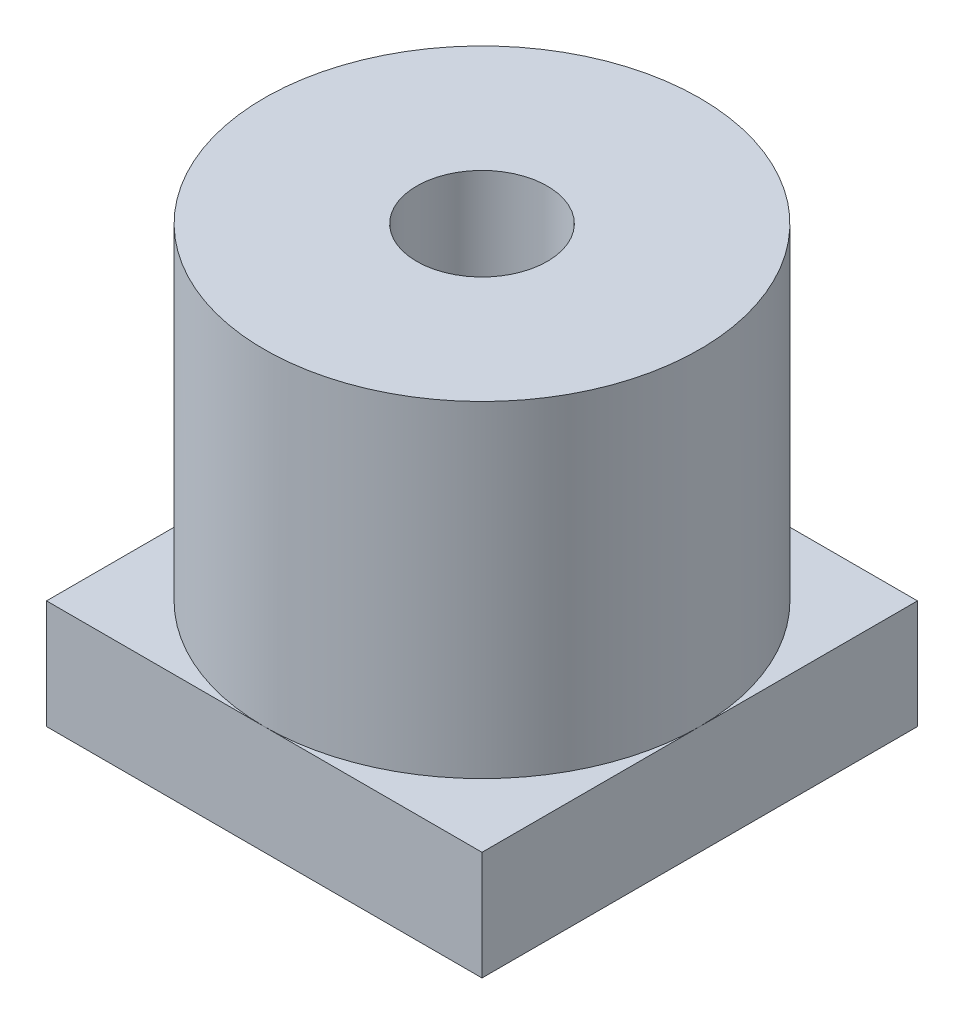
ISO-10303-21;
HEADER;
FILE_DESCRIPTION(('STEP AP214'),'2;1');
FILE_NAME('part.step','',(''),(''),'','','');
FILE_SCHEMA(('AUTOMOTIVE_DESIGN { 1 0 10303 214 1 1 1 1 }'));
ENDSEC;
DATA;
#1=APPLICATION_CONTEXT('core data for automotive mechanical design processes');
#2=APPLICATION_PROTOCOL_DEFINITION('international standard','automotive_design',2000,#1);
#3=PRODUCT_CONTEXT('',#1,'mechanical');
#4=PRODUCT('Part','Part','',(#3));
#5=PRODUCT_RELATED_PRODUCT_CATEGORY('part','',(#4));
#6=PRODUCT_DEFINITION_FORMATION('','',#4);
#7=PRODUCT_DEFINITION_CONTEXT('part definition',#1,'design');
#8=PRODUCT_DEFINITION('design','',#6,#7);
#9=PRODUCT_DEFINITION_SHAPE('','',#8);
#10=(LENGTH_UNIT() NAMED_UNIT(*) SI_UNIT(.MILLI.,.METRE.));
#11=(NAMED_UNIT(*) PLANE_ANGLE_UNIT() SI_UNIT($,.RADIAN.));
#12=(NAMED_UNIT(*) SI_UNIT($,.STERADIAN.) SOLID_ANGLE_UNIT());
#13=UNCERTAINTY_MEASURE_WITH_UNIT(LENGTH_MEASURE(1.E-05),#10,'distance_accuracy_value','');
#14=(GEOMETRIC_REPRESENTATION_CONTEXT(3) GLOBAL_UNCERTAINTY_ASSIGNED_CONTEXT((#13)) GLOBAL_UNIT_ASSIGNED_CONTEXT((#10,
#11,#12)) REPRESENTATION_CONTEXT('',''));
#15=CARTESIAN_POINT('',(0.,0.,0.));
#16=DIRECTION('',(0.,0.,1.));
#17=DIRECTION('',(1.,0.,0.));
#18=AXIS2_PLACEMENT_3D('',#15,#16,#17);
#19=CARTESIAN_POINT('',(0.,20.,0.));
#20=DIRECTION('',(1.,0.,0.));
#21=DIRECTION('',(0.,0.,-1.));
#22=AXIS2_PLACEMENT_3D('',#19,#20,#21);
#23=PLANE('',#22);
#24=DIRECTION('',(0.,0.,1.));
#25=VECTOR('',#24,1.);
#26=CARTESIAN_POINT('',(0.,5.,0.));
#27=LINE('',#26,#25);
#28=CARTESIAN_POINT('',(0.,5.,-20.));
#29=VERTEX_POINT('',#28);
#30=CARTESIAN_POINT('',(0.,5.,-10.));
#31=VERTEX_POINT('',#30);
#32=EDGE_CURVE('E120',#29,#31,#27,.T.);
#33=ORIENTED_EDGE('',*,*,#32,.F.);
#34=DIRECTION('',(0.,-1.,0.));
#35=VECTOR('',#34,1.);
#36=CARTESIAN_POINT('',(0.,20.,-20.));
#37=LINE('',#36,#35);
#38=CARTESIAN_POINT('',(0.,0.,-20.));
#39=VERTEX_POINT('',#38);
#40=EDGE_CURVE('E56',#29,#39,#37,.T.);
#41=ORIENTED_EDGE('',*,*,#40,.T.);
#42=DIRECTION('',(0.,0.,1.));
#43=VECTOR('',#42,1.);
#44=CARTESIAN_POINT('',(0.,0.,0.));
#45=LINE('',#44,#43);
#46=CARTESIAN_POINT('',(0.,0.,0.));
#47=VERTEX_POINT('',#46);
#48=EDGE_CURVE('E121',#39,#47,#45,.T.);
#49=ORIENTED_EDGE('',*,*,#48,.T.);
#50=DIRECTION('',(0.,-1.,0.));
#51=VECTOR('',#50,1.);
#52=CARTESIAN_POINT('',(0.,20.,0.));
#53=LINE('',#52,#51);
#54=CARTESIAN_POINT('',(0.,5.,0.));
#55=VERTEX_POINT('',#54);
#56=EDGE_CURVE('E134',#55,#47,#53,.T.);
#57=ORIENTED_EDGE('',*,*,#56,.F.);
#58=EDGE_CURVE('E95',#31,#55,#27,.T.);
#59=ORIENTED_EDGE('',*,*,#58,.F.);
#60=EDGE_LOOP('',(#33,#41,#49,#57,#59));
#61=FACE_BOUND('',#60,.T.);
#62=ADVANCED_FACE('F34',(#61),#23,.F.);
#63=CARTESIAN_POINT('',(0.,20.,0.));
#64=DIRECTION('',(0.,0.,-1.));
#65=DIRECTION('',(-1.,0.,0.));
#66=AXIS2_PLACEMENT_3D('',#63,#64,#65);
#67=PLANE('',#66);
#68=DIRECTION('',(1.,0.,0.));
#69=VECTOR('',#68,1.);
#70=CARTESIAN_POINT('',(0.,5.,0.));
#71=LINE('',#70,#69);
#72=CARTESIAN_POINT('',(10.,5.,0.));
#73=VERTEX_POINT('',#72);
#74=EDGE_CURVE('E90',#55,#73,#71,.T.);
#75=ORIENTED_EDGE('',*,*,#74,.F.);
#76=ORIENTED_EDGE('',*,*,#56,.T.);
#77=DIRECTION('',(1.,0.,0.));
#78=VECTOR('',#77,1.);
#79=CARTESIAN_POINT('',(0.,0.,0.));
#80=LINE('',#79,#78);
#81=CARTESIAN_POINT('',(20.,0.,0.));
#82=VERTEX_POINT('',#81);
#83=EDGE_CURVE('E123',#47,#82,#80,.T.);
#84=ORIENTED_EDGE('',*,*,#83,.T.);
#85=DIRECTION('',(0.,-1.,0.));
#86=VECTOR('',#85,1.);
#87=CARTESIAN_POINT('',(20.,20.,0.));
#88=LINE('',#87,#86);
#89=CARTESIAN_POINT('',(20.,5.,0.));
#90=VERTEX_POINT('',#89);
#91=EDGE_CURVE('E116',#90,#82,#88,.T.);
#92=ORIENTED_EDGE('',*,*,#91,.F.);
#93=EDGE_CURVE('E99',#73,#90,#71,.T.);
#94=ORIENTED_EDGE('',*,*,#93,.F.);
#95=EDGE_LOOP('',(#75,#76,#84,#92,#94));
#96=FACE_BOUND('',#95,.T.);
#97=ADVANCED_FACE('F114',(#96),#67,.F.);
#98=CARTESIAN_POINT('',(20.,20.,0.));
#99=DIRECTION('',(-1.,0.,0.));
#100=DIRECTION('',(0.,0.,1.));
#101=AXIS2_PLACEMENT_3D('',#98,#99,#100);
#102=PLANE('',#101);
#103=DIRECTION('',(0.,0.,-1.));
#104=VECTOR('',#103,1.);
#105=CARTESIAN_POINT('',(20.,5.,0.));
#106=LINE('',#105,#104);
#107=CARTESIAN_POINT('',(20.,5.,-10.));
#108=VERTEX_POINT('',#107);
#109=EDGE_CURVE('E111',#90,#108,#106,.T.);
#110=ORIENTED_EDGE('',*,*,#109,.F.);
#111=ORIENTED_EDGE('',*,*,#91,.T.);
#112=DIRECTION('',(0.,0.,-1.));
#113=VECTOR('',#112,1.);
#114=CARTESIAN_POINT('',(20.,0.,0.));
#115=LINE('',#114,#113);
#116=CARTESIAN_POINT('',(20.,0.,-20.));
#117=VERTEX_POINT('',#116);
#118=EDGE_CURVE('E125',#82,#117,#115,.T.);
#119=ORIENTED_EDGE('',*,*,#118,.T.);
#120=DIRECTION('',(0.,-1.,0.));
#121=VECTOR('',#120,1.);
#122=CARTESIAN_POINT('',(20.,20.,-20.));
#123=LINE('',#122,#121);
#124=CARTESIAN_POINT('',(20.,5.,-20.));
#125=VERTEX_POINT('',#124);
#126=EDGE_CURVE('E131',#125,#117,#123,.T.);
#127=ORIENTED_EDGE('',*,*,#126,.F.);
#128=EDGE_CURVE('E112',#108,#125,#106,.T.);
#129=ORIENTED_EDGE('',*,*,#128,.F.);
#130=EDGE_LOOP('',(#110,#111,#119,#127,#129));
#131=FACE_BOUND('',#130,.T.);
#132=ADVANCED_FACE('F153',(#131),#102,.F.);
#133=CARTESIAN_POINT('',(0.,20.,-20.));
#134=DIRECTION('',(0.,0.,1.));
#135=DIRECTION('',(1.,0.,0.));
#136=AXIS2_PLACEMENT_3D('',#133,#134,#135);
#137=PLANE('',#136);
#138=DIRECTION('',(-1.,0.,0.));
#139=VECTOR('',#138,1.);
#140=CARTESIAN_POINT('',(0.,5.,-20.));
#141=LINE('',#140,#139);
#142=CARTESIAN_POINT('',(10.,5.,-20.));
#143=VERTEX_POINT('',#142);
#144=EDGE_CURVE('E12',#125,#143,#141,.T.);
#145=ORIENTED_EDGE('',*,*,#144,.F.);
#146=ORIENTED_EDGE('',*,*,#126,.T.);
#147=DIRECTION('',(-1.,0.,0.));
#148=VECTOR('',#147,1.);
#149=CARTESIAN_POINT('',(0.,0.,-20.));
#150=LINE('',#149,#148);
#151=EDGE_CURVE('E128',#117,#39,#150,.T.);
#152=ORIENTED_EDGE('',*,*,#151,.T.);
#153=ORIENTED_EDGE('',*,*,#40,.F.);
#154=EDGE_CURVE('E37',#143,#29,#141,.T.);
#155=ORIENTED_EDGE('',*,*,#154,.F.);
#156=EDGE_LOOP('',(#145,#146,#152,#153,#155));
#157=FACE_BOUND('',#156,.T.);
#158=ADVANCED_FACE('F144',(#157),#137,.F.);
#159=CARTESIAN_POINT('',(0.,0.,0.));
#160=DIRECTION('',(0.,-1.,0.));
#161=DIRECTION('',(0.,0.,-1.));
#162=AXIS2_PLACEMENT_3D('',#159,#160,#161);
#163=PLANE('',#162);
#164=CARTESIAN_POINT('',(10.,0.,-10.));
#165=DIRECTION('',(0.,1.,0.));
#166=DIRECTION('',(0.,0.,1.));
#167=AXIS2_PLACEMENT_3D('',#164,#165,#166);
#168=CIRCLE('',#167,3.);
#169=CARTESIAN_POINT('',(10.,0.,-7.));
#170=VERTEX_POINT('',#169);
#171=EDGE_CURVE('E106',#170,#170,#168,.T.);
#172=ORIENTED_EDGE('',*,*,#171,.T.);
#173=EDGE_LOOP('',(#172));
#174=FACE_BOUND('',#173,.T.);
#175=ORIENTED_EDGE('',*,*,#48,.F.);
#176=ORIENTED_EDGE('',*,*,#151,.F.);
#177=ORIENTED_EDGE('',*,*,#118,.F.);
#178=ORIENTED_EDGE('',*,*,#83,.F.);
#179=EDGE_LOOP('',(#175,#176,#177,#178));
#180=FACE_BOUND('',#179,.T.);
#181=ADVANCED_FACE('F151',(#174,#180),#163,.T.);
#182=CARTESIAN_POINT('',(10.,5.,-10.));
#183=DIRECTION('',(0.,1.,0.));
#184=DIRECTION('',(0.,0.,1.));
#185=AXIS2_PLACEMENT_3D('',#182,#183,#184);
#186=PLANE('',#185);
#187=ORIENTED_EDGE('',*,*,#32,.T.);
#188=CARTESIAN_POINT('',(10.,5.,-10.));
#189=DIRECTION('',(0.,1.,0.));
#190=DIRECTION('',(0.,0.,1.));
#191=AXIS2_PLACEMENT_3D('',#188,#189,#190);
#192=CIRCLE('',#191,10.);
#193=EDGE_CURVE('E105',#143,#31,#192,.T.);
#194=ORIENTED_EDGE('',*,*,#193,.F.);
#195=ORIENTED_EDGE('',*,*,#154,.T.);
#196=EDGE_LOOP('',(#187,#194,#195));
#197=FACE_BOUND('',#196,.T.);
#198=ADVANCED_FACE('F141',(#197),#186,.T.);
#199=ORIENTED_EDGE('',*,*,#58,.T.);
#200=ORIENTED_EDGE('',*,*,#74,.T.);
#201=EDGE_CURVE('E93',#31,#73,#192,.T.);
#202=ORIENTED_EDGE('',*,*,#201,.F.);
#203=EDGE_LOOP('',(#199,#200,#202));
#204=FACE_BOUND('',#203,.T.);
#205=ADVANCED_FACE('F92',(#204),#186,.T.);
#206=ORIENTED_EDGE('',*,*,#93,.T.);
#207=ORIENTED_EDGE('',*,*,#109,.T.);
#208=EDGE_CURVE('E103',#73,#108,#192,.T.);
#209=ORIENTED_EDGE('',*,*,#208,.F.);
#210=EDGE_LOOP('',(#206,#207,#209));
#211=FACE_BOUND('',#210,.T.);
#212=ADVANCED_FACE('F109',(#211),#186,.T.);
#213=ORIENTED_EDGE('',*,*,#128,.T.);
#214=ORIENTED_EDGE('',*,*,#144,.T.);
#215=EDGE_CURVE('E48',#108,#143,#192,.T.);
#216=ORIENTED_EDGE('',*,*,#215,.F.);
#217=EDGE_LOOP('',(#213,#214,#216));
#218=FACE_BOUND('',#217,.T.);
#219=ADVANCED_FACE('F155',(#218),#186,.T.);
#220=CARTESIAN_POINT('',(10.,5.,-10.));
#221=DIRECTION('',(0.,1.,0.));
#222=DIRECTION('',(0.,0.,1.));
#223=AXIS2_PLACEMENT_3D('',#220,#221,#222);
#224=CYLINDRICAL_SURFACE('',#223,10.);
#225=CARTESIAN_POINT('',(10.,20.,-10.));
#226=DIRECTION('',(0.,-1.,0.));
#227=DIRECTION('',(0.,0.,-1.));
#228=AXIS2_PLACEMENT_3D('',#225,#226,#227);
#229=CIRCLE('',#228,10.);
#230=CARTESIAN_POINT('',(10.,20.,-20.));
#231=VERTEX_POINT('',#230);
#232=EDGE_CURVE('E135',#231,#231,#229,.T.);
#233=ORIENTED_EDGE('',*,*,#232,.T.);
#234=EDGE_LOOP('',(#233));
#235=FACE_BOUND('',#234,.T.);
#236=ORIENTED_EDGE('',*,*,#193,.T.);
#237=ORIENTED_EDGE('',*,*,#201,.T.);
#238=ORIENTED_EDGE('',*,*,#208,.T.);
#239=ORIENTED_EDGE('',*,*,#215,.T.);
#240=EDGE_LOOP('',(#236,#237,#238,#239));
#241=FACE_BOUND('',#240,.T.);
#242=ADVANCED_FACE('F102',(#235,#241),#224,.T.);
#243=CARTESIAN_POINT('',(0.,20.,0.));
#244=DIRECTION('',(0.,-1.,0.));
#245=DIRECTION('',(0.,0.,-1.));
#246=AXIS2_PLACEMENT_3D('',#243,#244,#245);
#247=PLANE('',#246);
#248=CARTESIAN_POINT('',(10.,20.,-10.));
#249=DIRECTION('',(0.,1.,0.));
#250=DIRECTION('',(0.,0.,1.));
#251=AXIS2_PLACEMENT_3D('',#248,#249,#250);
#252=CIRCLE('',#251,3.);
#253=CARTESIAN_POINT('',(10.,20.,-7.));
#254=VERTEX_POINT('',#253);
#255=EDGE_CURVE('E157',#254,#254,#252,.T.);
#256=ORIENTED_EDGE('',*,*,#255,.F.);
#257=EDGE_LOOP('',(#256));
#258=FACE_BOUND('',#257,.T.);
#259=ORIENTED_EDGE('',*,*,#232,.F.);
#260=EDGE_LOOP('',(#259));
#261=FACE_BOUND('',#260,.T.);
#262=ADVANCED_FACE('F167',(#258,#261),#247,.F.);
#263=CARTESIAN_POINT('',(10.,0.,-10.));
#264=DIRECTION('',(0.,1.,0.));
#265=DIRECTION('',(0.,0.,1.));
#266=AXIS2_PLACEMENT_3D('',#263,#264,#265);
#267=CYLINDRICAL_SURFACE('',#266,3.);
#268=ORIENTED_EDGE('',*,*,#171,.F.);
#269=EDGE_LOOP('',(#268));
#270=FACE_BOUND('',#269,.T.);
#271=ORIENTED_EDGE('',*,*,#255,.T.);
#272=EDGE_LOOP('',(#271));
#273=FACE_BOUND('',#272,.T.);
#274=ADVANCED_FACE('F164',(#270,#273),#267,.F.);
#275=CLOSED_SHELL('',(#62,#97,#132,#158,#181,#198,#205,#212,#219,#242,#262,#274));
#276=MANIFOLD_SOLID_BREP('B2',#275);
#277=ADVANCED_BREP_SHAPE_REPRESENTATION('',(#18,#276),#14);
#278=SHAPE_DEFINITION_REPRESENTATION(#9,#277);
ENDSEC;
END-ISO-10303-21;
